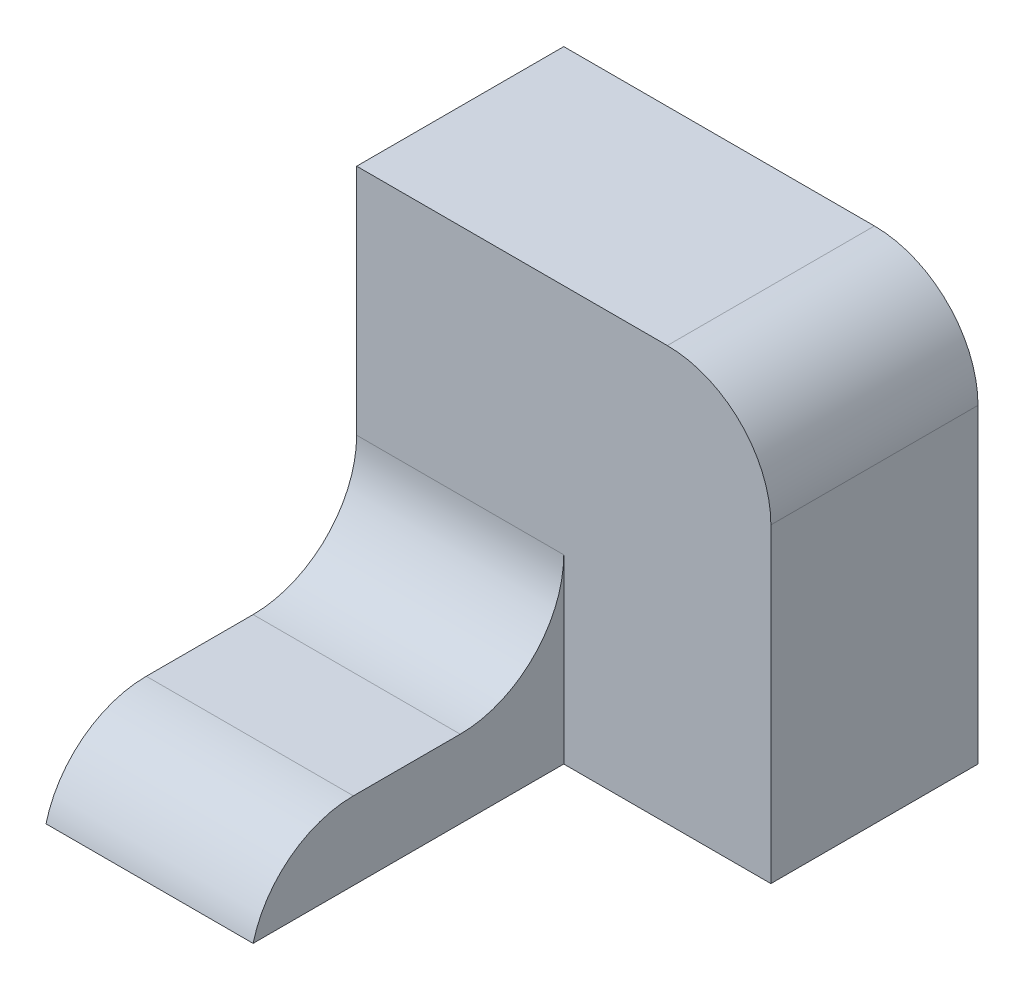
ISO-10303-21;
HEADER;
FILE_DESCRIPTION(('STEP AP214'),'2;1');
FILE_NAME('part.step','',(''),(''),'','','');
FILE_SCHEMA(('AUTOMOTIVE_DESIGN { 1 0 10303 214 1 1 1 1 }'));
ENDSEC;
DATA;
#1=APPLICATION_CONTEXT('core data for automotive mechanical design processes');
#2=APPLICATION_PROTOCOL_DEFINITION('international standard','automotive_design',2000,#1);
#3=PRODUCT_CONTEXT('',#1,'mechanical');
#4=PRODUCT('Part','Part','',(#3));
#5=PRODUCT_RELATED_PRODUCT_CATEGORY('part','',(#4));
#6=PRODUCT_DEFINITION_FORMATION('','',#4);
#7=PRODUCT_DEFINITION_CONTEXT('part definition',#1,'design');
#8=PRODUCT_DEFINITION('design','',#6,#7);
#9=PRODUCT_DEFINITION_SHAPE('','',#8);
#10=(LENGTH_UNIT() NAMED_UNIT(*) SI_UNIT(.MILLI.,.METRE.));
#11=(NAMED_UNIT(*) PLANE_ANGLE_UNIT() SI_UNIT($,.RADIAN.));
#12=(NAMED_UNIT(*) SI_UNIT($,.STERADIAN.) SOLID_ANGLE_UNIT());
#13=UNCERTAINTY_MEASURE_WITH_UNIT(LENGTH_MEASURE(1.E-05),#10,'distance_accuracy_value','');
#14=(GEOMETRIC_REPRESENTATION_CONTEXT(3) GLOBAL_UNCERTAINTY_ASSIGNED_CONTEXT((#13)) GLOBAL_UNIT_ASSIGNED_CONTEXT((#10,
#11,#12)) REPRESENTATION_CONTEXT('',''));
#15=CARTESIAN_POINT('',(0.,0.,0.));
#16=DIRECTION('',(0.,0.,1.));
#17=DIRECTION('',(1.,0.,0.));
#18=AXIS2_PLACEMENT_3D('',#15,#16,#17);
#19=CARTESIAN_POINT('',(-10.,0.,30.));
#20=DIRECTION('',(0.,-1.,0.));
#21=DIRECTION('',(1.,0.,0.));
#22=AXIS2_PLACEMENT_3D('',#19,#20,#21);
#23=PLANE('',#22);
#24=DIRECTION('',(0.,0.,-1.));
#25=VECTOR('',#24,1.);
#26=CARTESIAN_POINT('',(-10.,0.,30.));
#27=LINE('',#26,#25);
#28=CARTESIAN_POINT('',(-10.,0.,20.3175416344815));
#29=VERTEX_POINT('',#28);
#30=CARTESIAN_POINT('',(-10.,0.,10.));
#31=VERTEX_POINT('',#30);
#32=EDGE_CURVE('E144',#29,#31,#27,.T.);
#33=ORIENTED_EDGE('',*,*,#32,.T.);
#34=DIRECTION('',(-1.,0.,0.));
#35=VECTOR('',#34,1.);
#36=CARTESIAN_POINT('',(-10.,0.,10.));
#37=LINE('',#36,#35);
#38=CARTESIAN_POINT('',(-30.,0.,10.));
#39=VERTEX_POINT('',#38);
#40=EDGE_CURVE('E158',#31,#39,#37,.T.);
#41=ORIENTED_EDGE('',*,*,#40,.T.);
#42=DIRECTION('',(0.,0.,-1.));
#43=VECTOR('',#42,1.);
#44=CARTESIAN_POINT('',(-30.,0.,30.));
#45=LINE('',#44,#43);
#46=CARTESIAN_POINT('',(-30.,0.,20.3175416344815));
#47=VERTEX_POINT('',#46);
#48=EDGE_CURVE('E153',#47,#39,#45,.T.);
#49=ORIENTED_EDGE('',*,*,#48,.F.);
#50=DIRECTION('',(-1.,0.,0.));
#51=VECTOR('',#50,1.);
#52=CARTESIAN_POINT('',(-10.,0.,20.3175416344815));
#53=LINE('',#52,#51);
#54=EDGE_CURVE('E156',#47,#29,#53,.F.);
#55=ORIENTED_EDGE('',*,*,#54,.T.);
#56=EDGE_LOOP('',(#33,#41,#49,#55));
#57=FACE_BOUND('',#56,.T.);
#58=ADVANCED_FACE('F35',(#57),#23,.F.);
#59=CARTESIAN_POINT('',(-30.,0.,30.));
#60=DIRECTION('',(1.,0.,0.));
#61=DIRECTION('',(0.,0.,-1.));
#62=AXIS2_PLACEMENT_3D('',#59,#60,#61);
#63=PLANE('',#62);
#64=DIRECTION('',(0.,0.,-1.));
#65=VECTOR('',#64,1.);
#66=CARTESIAN_POINT('',(-30.,-7.5,30.));
#67=LINE('',#66,#65);
#68=CARTESIAN_POINT('',(-30.,-7.5,30.));
#69=VERTEX_POINT('',#68);
#70=CARTESIAN_POINT('',(-30.,-7.5,-20.));
#71=VERTEX_POINT('',#70);
#72=EDGE_CURVE('E151',#69,#71,#67,.T.);
#73=ORIENTED_EDGE('',*,*,#72,.F.);
#74=CARTESIAN_POINT('',(-30.,-10.,20.3175416344815));
#75=DIRECTION('',(1.,0.,0.));
#76=DIRECTION('',(0.,0.,-1.));
#77=AXIS2_PLACEMENT_3D('',#74,#75,#76);
#78=CIRCLE('',#77,10.);
#79=EDGE_CURVE('E171',#69,#47,#78,.F.);
#80=ORIENTED_EDGE('',*,*,#79,.T.);
#81=ORIENTED_EDGE('',*,*,#48,.T.);
#82=CARTESIAN_POINT('',(-30.,10.,10.));
#83=DIRECTION('',(1.,0.,0.));
#84=DIRECTION('',(0.,0.,-1.));
#85=AXIS2_PLACEMENT_3D('',#82,#83,#84);
#86=CIRCLE('',#85,10.);
#87=CARTESIAN_POINT('',(-30.,10.,0.));
#88=VERTEX_POINT('',#87);
#89=EDGE_CURVE('E43',#39,#88,#86,.T.);
#90=ORIENTED_EDGE('',*,*,#89,.T.);
#91=DIRECTION('',(0.,-1.,0.));
#92=VECTOR('',#91,1.);
#93=CARTESIAN_POINT('',(-30.,32.5,0.));
#94=LINE('',#93,#92);
#95=CARTESIAN_POINT('',(-30.,32.5,0.));
#96=VERTEX_POINT('',#95);
#97=EDGE_CURVE('E119',#96,#88,#94,.T.);
#98=ORIENTED_EDGE('',*,*,#97,.F.);
#99=DIRECTION('',(0.,0.,1.));
#100=VECTOR('',#99,1.);
#101=CARTESIAN_POINT('',(-30.,32.5,-20.));
#102=LINE('',#101,#100);
#103=CARTESIAN_POINT('',(-30.,32.5,-20.));
#104=VERTEX_POINT('',#103);
#105=EDGE_CURVE('E108',#104,#96,#102,.T.);
#106=ORIENTED_EDGE('',*,*,#105,.F.);
#107=DIRECTION('',(0.,-1.,0.));
#108=VECTOR('',#107,1.);
#109=CARTESIAN_POINT('',(-30.,32.5,-20.));
#110=LINE('',#109,#108);
#111=EDGE_CURVE('E111',#104,#71,#110,.T.);
#112=ORIENTED_EDGE('',*,*,#111,.T.);
#113=EDGE_LOOP('',(#73,#80,#81,#90,#98,#106,#112));
#114=FACE_BOUND('',#113,.T.);
#115=ADVANCED_FACE('F117',(#114),#63,.F.);
#116=CARTESIAN_POINT('',(-30.,-7.5,30.));
#117=DIRECTION('',(0.,1.,0.));
#118=DIRECTION('',(0.,0.,1.));
#119=AXIS2_PLACEMENT_3D('',#116,#117,#118);
#120=PLANE('',#119);
#121=ORIENTED_EDGE('',*,*,#72,.T.);
#122=DIRECTION('',(1.,0.,0.));
#123=VECTOR('',#122,1.);
#124=CARTESIAN_POINT('',(-30.,-7.5,-20.));
#125=LINE('',#124,#123);
#126=CARTESIAN_POINT('',(10.,-7.5,-20.));
#127=VERTEX_POINT('',#126);
#128=EDGE_CURVE('E126',#71,#127,#125,.T.);
#129=ORIENTED_EDGE('',*,*,#128,.T.);
#130=DIRECTION('',(0.,0.,1.));
#131=VECTOR('',#130,1.);
#132=CARTESIAN_POINT('',(10.,-7.5,-20.));
#133=LINE('',#132,#131);
#134=CARTESIAN_POINT('',(10.,-7.5,0.));
#135=VERTEX_POINT('',#134);
#136=EDGE_CURVE('E120',#127,#135,#133,.T.);
#137=ORIENTED_EDGE('',*,*,#136,.T.);
#138=DIRECTION('',(1.,0.,0.));
#139=VECTOR('',#138,1.);
#140=CARTESIAN_POINT('',(-30.,-7.5,0.));
#141=LINE('',#140,#139);
#142=CARTESIAN_POINT('',(-10.,-7.5,0.));
#143=VERTEX_POINT('',#142);
#144=EDGE_CURVE('E134',#143,#135,#141,.T.);
#145=ORIENTED_EDGE('',*,*,#144,.F.);
#146=DIRECTION('',(0.,0.,-1.));
#147=VECTOR('',#146,1.);
#148=CARTESIAN_POINT('',(-10.,-7.5,30.));
#149=LINE('',#148,#147);
#150=CARTESIAN_POINT('',(-10.,-7.5,30.));
#151=VERTEX_POINT('',#150);
#152=EDGE_CURVE('E148',#151,#143,#149,.T.);
#153=ORIENTED_EDGE('',*,*,#152,.F.);
#154=DIRECTION('',(1.,0.,0.));
#155=VECTOR('',#154,1.);
#156=CARTESIAN_POINT('',(-30.,-7.5,30.));
#157=LINE('',#156,#155);
#158=EDGE_CURVE('E141',#69,#151,#157,.T.);
#159=ORIENTED_EDGE('',*,*,#158,.F.);
#160=EDGE_LOOP('',(#121,#129,#137,#145,#153,#159));
#161=FACE_BOUND('',#160,.T.);
#162=ADVANCED_FACE('F193',(#161),#120,.F.);
#163=CARTESIAN_POINT('',(-10.,-7.5,30.));
#164=DIRECTION('',(-1.,0.,0.));
#165=DIRECTION('',(0.,0.,1.));
#166=AXIS2_PLACEMENT_3D('',#163,#164,#165);
#167=PLANE('',#166);
#168=ORIENTED_EDGE('',*,*,#32,.F.);
#169=CARTESIAN_POINT('',(-10.,-10.,20.3175416344815));
#170=DIRECTION('',(-1.,0.,0.));
#171=DIRECTION('',(0.,0.,1.));
#172=AXIS2_PLACEMENT_3D('',#169,#170,#171);
#173=CIRCLE('',#172,10.);
#174=EDGE_CURVE('E173',#29,#151,#173,.F.);
#175=ORIENTED_EDGE('',*,*,#174,.T.);
#176=ORIENTED_EDGE('',*,*,#152,.T.);
#177=DIRECTION('',(0.,1.,0.));
#178=VECTOR('',#177,1.);
#179=CARTESIAN_POINT('',(-10.,-7.5,0.));
#180=LINE('',#179,#178);
#181=CARTESIAN_POINT('',(-10.,10.,0.));
#182=VERTEX_POINT('',#181);
#183=EDGE_CURVE('E139',#143,#182,#180,.T.);
#184=ORIENTED_EDGE('',*,*,#183,.T.);
#185=CARTESIAN_POINT('',(-10.,10.,10.));
#186=DIRECTION('',(-1.,0.,0.));
#187=DIRECTION('',(0.,0.,1.));
#188=AXIS2_PLACEMENT_3D('',#185,#186,#187);
#189=CIRCLE('',#188,10.);
#190=EDGE_CURVE('E11',#182,#31,#189,.T.);
#191=ORIENTED_EDGE('',*,*,#190,.T.);
#192=EDGE_LOOP('',(#168,#175,#176,#184,#191));
#193=FACE_BOUND('',#192,.T.);
#194=ADVANCED_FACE('F184',(#193),#167,.F.);
#195=CARTESIAN_POINT('',(0.,0.,0.));
#196=DIRECTION('',(0.,0.,1.));
#197=DIRECTION('',(1.,0.,0.));
#198=AXIS2_PLACEMENT_3D('',#195,#196,#197);
#199=PLANE('',#198);
#200=ORIENTED_EDGE('',*,*,#97,.T.);
#201=DIRECTION('',(-1.,0.,0.));
#202=VECTOR('',#201,1.);
#203=CARTESIAN_POINT('',(0.,10.,0.));
#204=LINE('',#203,#202);
#205=EDGE_CURVE('E163',#88,#182,#204,.F.);
#206=ORIENTED_EDGE('',*,*,#205,.T.);
#207=ORIENTED_EDGE('',*,*,#183,.F.);
#208=ORIENTED_EDGE('',*,*,#144,.T.);
#209=DIRECTION('',(0.,1.,0.));
#210=VECTOR('',#209,1.);
#211=CARTESIAN_POINT('',(10.,-7.5,0.));
#212=LINE('',#211,#210);
#213=CARTESIAN_POINT('',(10.,22.5,0.));
#214=VERTEX_POINT('',#213);
#215=EDGE_CURVE('E112',#135,#214,#212,.T.);
#216=ORIENTED_EDGE('',*,*,#215,.T.);
#217=CARTESIAN_POINT('',(0.,22.5,0.));
#218=DIRECTION('',(0.,0.,1.));
#219=DIRECTION('',(1.,0.,0.));
#220=AXIS2_PLACEMENT_3D('',#217,#218,#219);
#221=CIRCLE('',#220,10.);
#222=CARTESIAN_POINT('',(0.,32.5,0.));
#223=VERTEX_POINT('',#222);
#224=EDGE_CURVE('E161',#214,#223,#221,.T.);
#225=ORIENTED_EDGE('',*,*,#224,.T.);
#226=DIRECTION('',(-1.,0.,0.));
#227=VECTOR('',#226,1.);
#228=CARTESIAN_POINT('',(10.,32.5,0.));
#229=LINE('',#228,#227);
#230=EDGE_CURVE('E131',#223,#96,#229,.T.);
#231=ORIENTED_EDGE('',*,*,#230,.T.);
#232=EDGE_LOOP('',(#200,#206,#207,#208,#216,#225,#231));
#233=FACE_BOUND('',#232,.T.);
#234=ADVANCED_FACE('F179',(#233),#199,.T.);
#235=CARTESIAN_POINT('',(10.,32.5,-20.));
#236=DIRECTION('',(0.,1.,0.));
#237=DIRECTION('',(-1.,0.,0.));
#238=AXIS2_PLACEMENT_3D('',#235,#236,#237);
#239=PLANE('',#238);
#240=ORIENTED_EDGE('',*,*,#230,.F.);
#241=DIRECTION('',(0.,0.,1.));
#242=VECTOR('',#241,1.);
#243=CARTESIAN_POINT('',(0.,32.5,-20.));
#244=LINE('',#243,#242);
#245=CARTESIAN_POINT('',(0.,32.5,-20.));
#246=VERTEX_POINT('',#245);
#247=EDGE_CURVE('E50',#223,#246,#244,.F.);
#248=ORIENTED_EDGE('',*,*,#247,.T.);
#249=DIRECTION('',(-1.,0.,0.));
#250=VECTOR('',#249,1.);
#251=CARTESIAN_POINT('',(10.,32.5,-20.));
#252=LINE('',#251,#250);
#253=EDGE_CURVE('E105',#246,#104,#252,.T.);
#254=ORIENTED_EDGE('',*,*,#253,.T.);
#255=ORIENTED_EDGE('',*,*,#105,.T.);
#256=EDGE_LOOP('',(#240,#248,#254,#255));
#257=FACE_BOUND('',#256,.T.);
#258=ADVANCED_FACE('F107',(#257),#239,.T.);
#259=CARTESIAN_POINT('',(10.,-7.5,-20.));
#260=DIRECTION('',(1.,0.,0.));
#261=DIRECTION('',(0.,0.,-1.));
#262=AXIS2_PLACEMENT_3D('',#259,#260,#261);
#263=PLANE('',#262);
#264=DIRECTION('',(0.,1.,0.));
#265=VECTOR('',#264,1.);
#266=CARTESIAN_POINT('',(10.,-7.5,-20.));
#267=LINE('',#266,#265);
#268=CARTESIAN_POINT('',(10.,22.5,-20.));
#269=VERTEX_POINT('',#268);
#270=EDGE_CURVE('E121',#127,#269,#267,.T.);
#271=ORIENTED_EDGE('',*,*,#270,.T.);
#272=DIRECTION('',(0.,0.,1.));
#273=VECTOR('',#272,1.);
#274=CARTESIAN_POINT('',(10.,22.5,-20.));
#275=LINE('',#274,#273);
#276=EDGE_CURVE('E166',#269,#214,#275,.T.);
#277=ORIENTED_EDGE('',*,*,#276,.T.);
#278=ORIENTED_EDGE('',*,*,#215,.F.);
#279=ORIENTED_EDGE('',*,*,#136,.F.);
#280=EDGE_LOOP('',(#271,#277,#278,#279));
#281=FACE_BOUND('',#280,.T.);
#282=ADVANCED_FACE('F196',(#281),#263,.T.);
#283=CARTESIAN_POINT('',(0.,0.,-20.));
#284=DIRECTION('',(0.,0.,1.));
#285=DIRECTION('',(1.,0.,0.));
#286=AXIS2_PLACEMENT_3D('',#283,#284,#285);
#287=PLANE('',#286);
#288=ORIENTED_EDGE('',*,*,#253,.F.);
#289=CARTESIAN_POINT('',(0.,22.5,-20.));
#290=DIRECTION('',(0.,0.,1.));
#291=DIRECTION('',(1.,0.,0.));
#292=AXIS2_PLACEMENT_3D('',#289,#290,#291);
#293=CIRCLE('',#292,10.);
#294=EDGE_CURVE('E57',#246,#269,#293,.F.);
#295=ORIENTED_EDGE('',*,*,#294,.T.);
#296=ORIENTED_EDGE('',*,*,#270,.F.);
#297=ORIENTED_EDGE('',*,*,#128,.F.);
#298=ORIENTED_EDGE('',*,*,#111,.F.);
#299=EDGE_LOOP('',(#288,#295,#296,#297,#298));
#300=FACE_BOUND('',#299,.T.);
#301=ADVANCED_FACE('F124',(#300),#287,.F.);
#302=CARTESIAN_POINT('',(-10.,10.,10.));
#303=DIRECTION('',(-1.,0.,0.));
#304=DIRECTION('',(0.,-1.,0.));
#305=AXIS2_PLACEMENT_3D('',#302,#303,#304);
#306=CYLINDRICAL_SURFACE('',#305,10.);
#307=ORIENTED_EDGE('',*,*,#190,.F.);
#308=ORIENTED_EDGE('',*,*,#205,.F.);
#309=ORIENTED_EDGE('',*,*,#89,.F.);
#310=ORIENTED_EDGE('',*,*,#40,.F.);
#311=EDGE_LOOP('',(#307,#308,#309,#310));
#312=FACE_BOUND('',#311,.T.);
#313=ADVANCED_FACE('F181',(#312),#306,.F.);
#314=CARTESIAN_POINT('',(0.,22.5,-20.));
#315=DIRECTION('',(0.,0.,1.));
#316=DIRECTION('',(1.,0.,0.));
#317=AXIS2_PLACEMENT_3D('',#314,#315,#316);
#318=CYLINDRICAL_SURFACE('',#317,10.);
#319=ORIENTED_EDGE('',*,*,#294,.F.);
#320=ORIENTED_EDGE('',*,*,#247,.F.);
#321=ORIENTED_EDGE('',*,*,#224,.F.);
#322=ORIENTED_EDGE('',*,*,#276,.F.);
#323=EDGE_LOOP('',(#319,#320,#321,#322));
#324=FACE_BOUND('',#323,.T.);
#325=ADVANCED_FACE('F199',(#324),#318,.T.);
#326=CARTESIAN_POINT('',(0.,-10.,20.3175416344815));
#327=DIRECTION('',(-1.,0.,0.));
#328=DIRECTION('',(0.,0.,1.));
#329=AXIS2_PLACEMENT_3D('',#326,#327,#328);
#330=CYLINDRICAL_SURFACE('',#329,10.);
#331=ORIENTED_EDGE('',*,*,#174,.F.);
#332=ORIENTED_EDGE('',*,*,#54,.F.);
#333=ORIENTED_EDGE('',*,*,#79,.F.);
#334=ORIENTED_EDGE('',*,*,#158,.T.);
#335=EDGE_LOOP('',(#331,#332,#333,#334));
#336=FACE_BOUND('',#335,.T.);
#337=ADVANCED_FACE('F37',(#336),#330,.T.);
#338=CLOSED_SHELL('',(#58,#115,#162,#194,#234,#258,#282,#301,#313,#325,#337));
#339=MANIFOLD_SOLID_BREP('B2',#338);
#340=ADVANCED_BREP_SHAPE_REPRESENTATION('',(#18,#339),#14);
#341=SHAPE_DEFINITION_REPRESENTATION(#9,#340);
ENDSEC;
END-ISO-10303-21;
